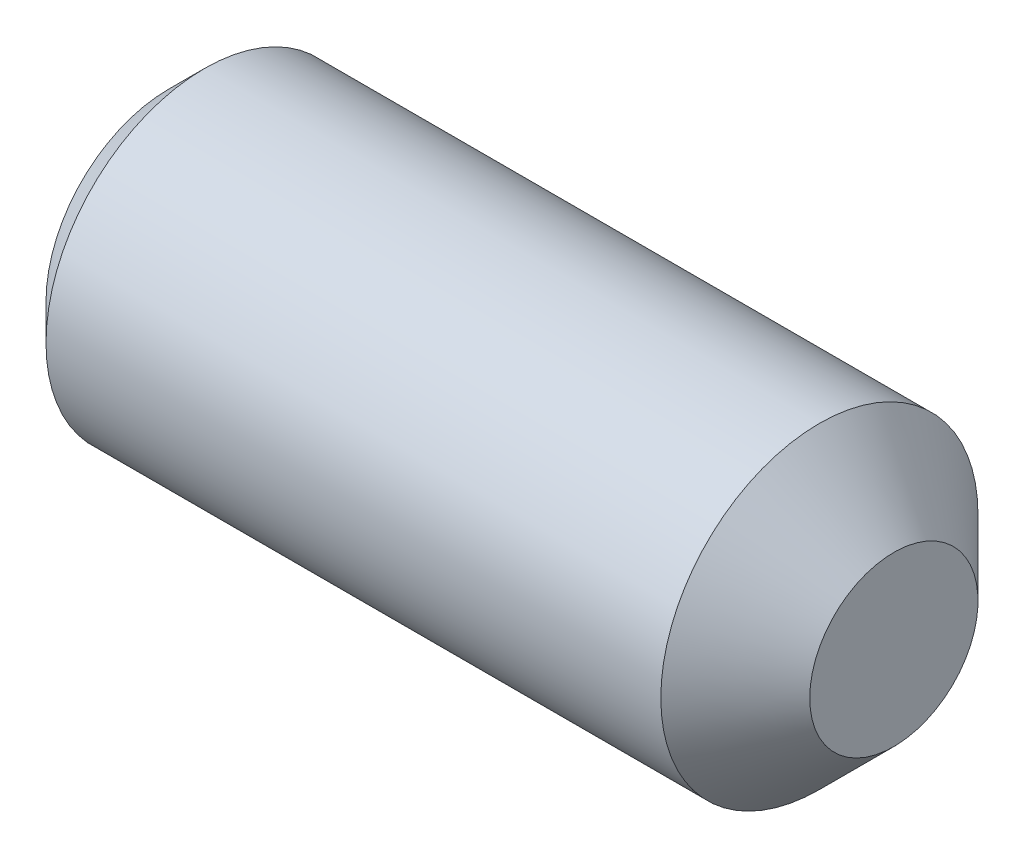
ISO-10303-21;
HEADER;
FILE_DESCRIPTION(('STEP AP214'),'2;1');
FILE_NAME('part.step','',(''),(''),'','','');
FILE_SCHEMA(('AUTOMOTIVE_DESIGN { 1 0 10303 214 1 1 1 1 }'));
ENDSEC;
DATA;
#1=APPLICATION_CONTEXT('core data for automotive mechanical design processes');
#2=APPLICATION_PROTOCOL_DEFINITION('international standard','automotive_design',2000,#1);
#3=PRODUCT_CONTEXT('',#1,'mechanical');
#4=PRODUCT('Part','Part','',(#3));
#5=PRODUCT_RELATED_PRODUCT_CATEGORY('part','',(#4));
#6=PRODUCT_DEFINITION_FORMATION('','',#4);
#7=PRODUCT_DEFINITION_CONTEXT('part definition',#1,'design');
#8=PRODUCT_DEFINITION('design','',#6,#7);
#9=PRODUCT_DEFINITION_SHAPE('','',#8);
#10=(LENGTH_UNIT() NAMED_UNIT(*) SI_UNIT(.MILLI.,.METRE.));
#11=(NAMED_UNIT(*) PLANE_ANGLE_UNIT() SI_UNIT($,.RADIAN.));
#12=(NAMED_UNIT(*) SI_UNIT($,.STERADIAN.) SOLID_ANGLE_UNIT());
#13=UNCERTAINTY_MEASURE_WITH_UNIT(LENGTH_MEASURE(1.E-05),#10,'distance_accuracy_value','');
#14=(GEOMETRIC_REPRESENTATION_CONTEXT(3) GLOBAL_UNCERTAINTY_ASSIGNED_CONTEXT((#13)) GLOBAL_UNIT_ASSIGNED_CONTEXT((#10,
#11,#12)) REPRESENTATION_CONTEXT('',''));
#15=CARTESIAN_POINT('',(0.,0.,0.));
#16=DIRECTION('',(0.,0.,1.));
#17=DIRECTION('',(1.,0.,0.));
#18=AXIS2_PLACEMENT_3D('',#15,#16,#17);
#19=CARTESIAN_POINT('',(0.,0.,0.));
#20=DIRECTION('',(-1.,0.,0.));
#21=DIRECTION('',(0.,0.,1.));
#22=AXIS2_PLACEMENT_3D('',#19,#20,#21);
#23=PLANE('',#22);
#24=CARTESIAN_POINT('',(0.,0.,0.));
#25=DIRECTION('',(-1.,0.,0.));
#26=DIRECTION('',(0.,0.,1.));
#27=AXIS2_PLACEMENT_3D('',#24,#25,#26);
#28=CIRCLE('',#27,1.61036);
#29=CARTESIAN_POINT('',(0.,0.,1.61036));
#30=VERTEX_POINT('',#29);
#31=EDGE_CURVE('E134',#30,#30,#28,.T.);
#32=ORIENTED_EDGE('',*,*,#31,.T.);
#33=EDGE_LOOP('',(#32));
#34=FACE_BOUND('',#33,.T.);
#35=DIRECTION('',(0.,0.,-1.));
#36=VECTOR('',#35,1.);
#37=CARTESIAN_POINT('',(0.,0.990600000000005,0.571923176659244));
#38=LINE('',#37,#36);
#39=CARTESIAN_POINT('',(0.,0.990600000000005,0.571923176659244));
#40=VERTEX_POINT('',#39);
#41=CARTESIAN_POINT('',(0.,0.990600000000005,-0.571923176659243));
#42=VERTEX_POINT('',#41);
#43=EDGE_CURVE('E125',#40,#42,#38,.T.);
#44=ORIENTED_EDGE('',*,*,#43,.F.);
#45=DIRECTION('',(0.,-0.866025403784439,0.5));
#46=VECTOR('',#45,1.);
#47=CARTESIAN_POINT('',(0.,0.990600000000005,0.571923176659244));
#48=LINE('',#47,#46);
#49=CARTESIAN_POINT('',(0.,0.,1.14384635331849));
#50=VERTEX_POINT('',#49);
#51=EDGE_CURVE('E47',#40,#50,#48,.T.);
#52=ORIENTED_EDGE('',*,*,#51,.T.);
#53=DIRECTION('',(0.,0.866025403784439,0.5));
#54=VECTOR('',#53,1.);
#55=CARTESIAN_POINT('',(0.,-0.990599999999996,0.571923176659244));
#56=LINE('',#55,#54);
#57=CARTESIAN_POINT('',(0.,-0.990599999999996,0.571923176659244));
#58=VERTEX_POINT('',#57);
#59=EDGE_CURVE('E116',#58,#50,#56,.T.);
#60=ORIENTED_EDGE('',*,*,#59,.F.);
#61=DIRECTION('',(0.,0.,-1.));
#62=VECTOR('',#61,1.);
#63=CARTESIAN_POINT('',(0.,-0.990599999999996,0.571923176659244));
#64=LINE('',#63,#62);
#65=CARTESIAN_POINT('',(0.,-0.990599999999996,-0.571923176659243));
#66=VERTEX_POINT('',#65);
#67=EDGE_CURVE('E119',#58,#66,#64,.T.);
#68=ORIENTED_EDGE('',*,*,#67,.T.);
#69=DIRECTION('',(0.,0.866025403784439,-0.5));
#70=VECTOR('',#69,1.);
#71=CARTESIAN_POINT('',(0.,-0.990599999999996,-0.571923176659243));
#72=LINE('',#71,#70);
#73=CARTESIAN_POINT('',(0.,0.,-1.14384635331849));
#74=VERTEX_POINT('',#73);
#75=EDGE_CURVE('E122',#66,#74,#72,.T.);
#76=ORIENTED_EDGE('',*,*,#75,.T.);
#77=DIRECTION('',(0.,-0.866025403784439,-0.5));
#78=VECTOR('',#77,1.);
#79=CARTESIAN_POINT('',(0.,0.990600000000005,-0.571923176659243));
#80=LINE('',#79,#78);
#81=EDGE_CURVE('E105',#42,#74,#80,.T.);
#82=ORIENTED_EDGE('',*,*,#81,.F.);
#83=EDGE_LOOP('',(#44,#52,#60,#68,#76,#82));
#84=FACE_BOUND('',#83,.T.);
#85=ADVANCED_FACE('F32',(#34,#84),#23,.T.);
#86=CARTESIAN_POINT('',(9.525,1.1049,0.));
#87=DIRECTION('',(1.,0.,0.));
#88=DIRECTION('',(0.,0.,-1.));
#89=AXIS2_PLACEMENT_3D('',#86,#87,#88);
#90=PLANE('',#89);
#91=CARTESIAN_POINT('',(9.525,0.,0.));
#92=DIRECTION('',(-1.,0.,0.));
#93=DIRECTION('',(0.,0.,1.));
#94=AXIS2_PLACEMENT_3D('',#91,#92,#93);
#95=CIRCLE('',#94,1.1049);
#96=CARTESIAN_POINT('',(9.525,0.,1.1049));
#97=VERTEX_POINT('',#96);
#98=EDGE_CURVE('E11',#97,#97,#95,.T.);
#99=ORIENTED_EDGE('',*,*,#98,.F.);
#100=EDGE_LOOP('',(#99));
#101=FACE_BOUND('',#100,.T.);
#102=ADVANCED_FACE('F34',(#101),#90,.T.);
#103=CARTESIAN_POINT('',(8.54710000000003,0.,0.));
#104=DIRECTION('',(-1.,0.,0.));
#105=DIRECTION('',(0.,0.,1.));
#106=AXIS2_PLACEMENT_3D('',#103,#104,#105);
#107=CONICAL_SURFACE('',#106,2.0828,0.785398163397463);
#108=ORIENTED_EDGE('',*,*,#98,.T.);
#109=EDGE_LOOP('',(#108));
#110=FACE_BOUND('',#109,.T.);
#111=CARTESIAN_POINT('',(8.54710000000003,0.,0.));
#112=DIRECTION('',(-1.,0.,0.));
#113=DIRECTION('',(0.,0.,1.));
#114=AXIS2_PLACEMENT_3D('',#111,#112,#113);
#115=CIRCLE('',#114,2.0828);
#116=CARTESIAN_POINT('',(8.54710000000003,0.,2.0828));
#117=VERTEX_POINT('',#116);
#118=EDGE_CURVE('E40',#117,#117,#115,.T.);
#119=ORIENTED_EDGE('',*,*,#118,.F.);
#120=EDGE_LOOP('',(#119));
#121=FACE_BOUND('',#120,.T.);
#122=ADVANCED_FACE('F145',(#110,#121),#107,.T.);
#123=CARTESIAN_POINT('',(-12.7,0.,0.));
#124=DIRECTION('',(-1.,0.,0.));
#125=DIRECTION('',(0.,0.,1.));
#126=AXIS2_PLACEMENT_3D('',#123,#124,#125);
#127=CYLINDRICAL_SURFACE('',#126,2.0828);
#128=ORIENTED_EDGE('',*,*,#118,.T.);
#129=EDGE_LOOP('',(#128));
#130=FACE_BOUND('',#129,.T.);
#131=CARTESIAN_POINT('',(0.472439999999998,0.,0.));
#132=DIRECTION('',(-1.,0.,0.));
#133=DIRECTION('',(0.,0.,1.));
#134=AXIS2_PLACEMENT_3D('',#131,#132,#133);
#135=CIRCLE('',#134,2.0828);
#136=CARTESIAN_POINT('',(0.472439999999998,0.,2.0828));
#137=VERTEX_POINT('',#136);
#138=EDGE_CURVE('E137',#137,#137,#135,.T.);
#139=ORIENTED_EDGE('',*,*,#138,.F.);
#140=EDGE_LOOP('',(#139));
#141=FACE_BOUND('',#140,.T.);
#142=ADVANCED_FACE('F142',(#130,#141),#127,.T.);
#143=CARTESIAN_POINT('',(0.,0.,0.));
#144=DIRECTION('',(1.,0.,0.));
#145=DIRECTION('',(0.,0.,-1.));
#146=AXIS2_PLACEMENT_3D('',#143,#144,#145);
#147=CONICAL_SURFACE('',#146,1.61036,0.78539816339745);
#148=ORIENTED_EDGE('',*,*,#138,.T.);
#149=EDGE_LOOP('',(#148));
#150=FACE_BOUND('',#149,.T.);
#151=ORIENTED_EDGE('',*,*,#31,.F.);
#152=EDGE_LOOP('',(#151));
#153=FACE_BOUND('',#152,.T.);
#154=ADVANCED_FACE('F152',(#150,#153),#147,.T.);
#155=CARTESIAN_POINT('',(2.286,0.990600000000005,0.571923176659244));
#156=DIRECTION('',(0.,-0.5,-0.866025403784439));
#157=DIRECTION('',(0.,0.866025403784439,-0.5));
#158=AXIS2_PLACEMENT_3D('',#155,#156,#157);
#159=PLANE('',#158);
#160=ORIENTED_EDGE('',*,*,#51,.F.);
#161=DIRECTION('',(-1.,0.,0.));
#162=VECTOR('',#161,1.);
#163=CARTESIAN_POINT('',(2.286,0.990600000000005,0.571923176659244));
#164=LINE('',#163,#162);
#165=CARTESIAN_POINT('',(2.286,0.990600000000005,0.571923176659244));
#166=VERTEX_POINT('',#165);
#167=EDGE_CURVE('E52',#166,#40,#164,.T.);
#168=ORIENTED_EDGE('',*,*,#167,.F.);
#169=DIRECTION('',(0.,-0.866025403784439,0.5));
#170=VECTOR('',#169,1.);
#171=CARTESIAN_POINT('',(2.286,0.990600000000005,0.571923176659244));
#172=LINE('',#171,#170);
#173=CARTESIAN_POINT('',(2.286,0.,1.14384635331849));
#174=VERTEX_POINT('',#173);
#175=EDGE_CURVE('E79',#166,#174,#172,.T.);
#176=ORIENTED_EDGE('',*,*,#175,.T.);
#177=DIRECTION('',(-1.,0.,0.));
#178=VECTOR('',#177,1.);
#179=CARTESIAN_POINT('',(2.286,0.,1.14384635331849));
#180=LINE('',#179,#178);
#181=EDGE_CURVE('E132',#174,#50,#180,.T.);
#182=ORIENTED_EDGE('',*,*,#181,.T.);
#183=EDGE_LOOP('',(#160,#168,#176,#182));
#184=FACE_BOUND('',#183,.T.);
#185=ADVANCED_FACE('F163',(#184),#159,.T.);
#186=CARTESIAN_POINT('',(2.286,-0.990599999999996,0.571923176659244));
#187=DIRECTION('',(0.,-0.5,0.866025403784439));
#188=DIRECTION('',(0.,-0.866025403784439,-0.5));
#189=AXIS2_PLACEMENT_3D('',#186,#187,#188);
#190=PLANE('',#189);
#191=ORIENTED_EDGE('',*,*,#59,.T.);
#192=ORIENTED_EDGE('',*,*,#181,.F.);
#193=DIRECTION('',(0.,0.866025403784439,0.5));
#194=VECTOR('',#193,1.);
#195=CARTESIAN_POINT('',(2.286,-0.990599999999996,0.571923176659244));
#196=LINE('',#195,#194);
#197=CARTESIAN_POINT('',(2.286,-0.990599999999996,0.571923176659244));
#198=VERTEX_POINT('',#197);
#199=EDGE_CURVE('E261',#198,#174,#196,.T.);
#200=ORIENTED_EDGE('',*,*,#199,.F.);
#201=DIRECTION('',(-1.,0.,0.));
#202=VECTOR('',#201,1.);
#203=CARTESIAN_POINT('',(2.286,-0.990599999999996,0.571923176659244));
#204=LINE('',#203,#202);
#205=EDGE_CURVE('E130',#198,#58,#204,.T.);
#206=ORIENTED_EDGE('',*,*,#205,.T.);
#207=EDGE_LOOP('',(#191,#192,#200,#206));
#208=FACE_BOUND('',#207,.T.);
#209=ADVANCED_FACE('F170',(#208),#190,.F.);
#210=CARTESIAN_POINT('',(2.286,-0.990599999999996,0.571923176659244));
#211=DIRECTION('',(0.,1.,0.));
#212=DIRECTION('',(0.,0.,1.));
#213=AXIS2_PLACEMENT_3D('',#210,#211,#212);
#214=PLANE('',#213);
#215=ORIENTED_EDGE('',*,*,#67,.F.);
#216=ORIENTED_EDGE('',*,*,#205,.F.);
#217=DIRECTION('',(0.,0.,-1.));
#218=VECTOR('',#217,1.);
#219=CARTESIAN_POINT('',(2.286,-0.990599999999996,0.571923176659244));
#220=LINE('',#219,#218);
#221=CARTESIAN_POINT('',(2.286,-0.990599999999996,-0.571923176659243));
#222=VERTEX_POINT('',#221);
#223=EDGE_CURVE('E100',#198,#222,#220,.T.);
#224=ORIENTED_EDGE('',*,*,#223,.T.);
#225=DIRECTION('',(-1.,0.,0.));
#226=VECTOR('',#225,1.);
#227=CARTESIAN_POINT('',(2.286,-0.990599999999996,-0.571923176659243));
#228=LINE('',#227,#226);
#229=EDGE_CURVE('E95',#222,#66,#228,.T.);
#230=ORIENTED_EDGE('',*,*,#229,.T.);
#231=EDGE_LOOP('',(#215,#216,#224,#230));
#232=FACE_BOUND('',#231,.T.);
#233=ADVANCED_FACE('F177',(#232),#214,.T.);
#234=CARTESIAN_POINT('',(2.286,-0.990599999999996,-0.571923176659243));
#235=DIRECTION('',(0.,0.5,0.866025403784439));
#236=DIRECTION('',(0.,-0.866025403784439,0.5));
#237=AXIS2_PLACEMENT_3D('',#234,#235,#236);
#238=PLANE('',#237);
#239=ORIENTED_EDGE('',*,*,#75,.F.);
#240=ORIENTED_EDGE('',*,*,#229,.F.);
#241=DIRECTION('',(0.,0.866025403784439,-0.5));
#242=VECTOR('',#241,1.);
#243=CARTESIAN_POINT('',(2.286,-0.990599999999996,-0.571923176659243));
#244=LINE('',#243,#242);
#245=CARTESIAN_POINT('',(2.286,0.,-1.14384635331849));
#246=VERTEX_POINT('',#245);
#247=EDGE_CURVE('E90',#222,#246,#244,.T.);
#248=ORIENTED_EDGE('',*,*,#247,.T.);
#249=DIRECTION('',(-1.,0.,0.));
#250=VECTOR('',#249,1.);
#251=CARTESIAN_POINT('',(2.286,0.,-1.14384635331849));
#252=LINE('',#251,#250);
#253=EDGE_CURVE('E94',#246,#74,#252,.T.);
#254=ORIENTED_EDGE('',*,*,#253,.T.);
#255=EDGE_LOOP('',(#239,#240,#248,#254));
#256=FACE_BOUND('',#255,.T.);
#257=ADVANCED_FACE('F93',(#256),#238,.T.);
#258=CARTESIAN_POINT('',(2.286,0.990600000000005,-0.571923176659243));
#259=DIRECTION('',(0.,0.5,-0.866025403784439));
#260=DIRECTION('',(0.,0.866025403784439,0.5));
#261=AXIS2_PLACEMENT_3D('',#258,#259,#260);
#262=PLANE('',#261);
#263=ORIENTED_EDGE('',*,*,#81,.T.);
#264=ORIENTED_EDGE('',*,*,#253,.F.);
#265=DIRECTION('',(0.,-0.866025403784439,-0.5));
#266=VECTOR('',#265,1.);
#267=CARTESIAN_POINT('',(2.286,0.990600000000005,-0.571923176659243));
#268=LINE('',#267,#266);
#269=CARTESIAN_POINT('',(2.286,0.990600000000005,-0.571923176659243));
#270=VERTEX_POINT('',#269);
#271=EDGE_CURVE('E99',#270,#246,#268,.T.);
#272=ORIENTED_EDGE('',*,*,#271,.F.);
#273=DIRECTION('',(-1.,0.,0.));
#274=VECTOR('',#273,1.);
#275=CARTESIAN_POINT('',(2.286,0.990600000000005,-0.571923176659243));
#276=LINE('',#275,#274);
#277=EDGE_CURVE('E75',#270,#42,#276,.T.);
#278=ORIENTED_EDGE('',*,*,#277,.T.);
#279=EDGE_LOOP('',(#263,#264,#272,#278));
#280=FACE_BOUND('',#279,.T.);
#281=ADVANCED_FACE('F102',(#280),#262,.F.);
#282=CARTESIAN_POINT('',(2.286,0.990600000000005,0.571923176659244));
#283=DIRECTION('',(0.,1.,0.));
#284=DIRECTION('',(0.,0.,1.));
#285=AXIS2_PLACEMENT_3D('',#282,#283,#284);
#286=PLANE('',#285);
#287=ORIENTED_EDGE('',*,*,#43,.T.);
#288=ORIENTED_EDGE('',*,*,#277,.F.);
#289=DIRECTION('',(0.,0.,-1.));
#290=VECTOR('',#289,1.);
#291=CARTESIAN_POINT('',(2.286,0.990600000000005,0.571923176659244));
#292=LINE('',#291,#290);
#293=EDGE_CURVE('E110',#166,#270,#292,.T.);
#294=ORIENTED_EDGE('',*,*,#293,.F.);
#295=ORIENTED_EDGE('',*,*,#167,.T.);
#296=EDGE_LOOP('',(#287,#288,#294,#295));
#297=FACE_BOUND('',#296,.T.);
#298=ADVANCED_FACE('F189',(#297),#286,.F.);
#299=CARTESIAN_POINT('',(2.286,-0.990599999999996,1.71576952997773));
#300=DIRECTION('',(1.,0.,0.));
#301=DIRECTION('',(0.,0.,-1.));
#302=AXIS2_PLACEMENT_3D('',#299,#300,#301);
#303=PLANE('',#302);
#304=ORIENTED_EDGE('',*,*,#175,.F.);
#305=ORIENTED_EDGE('',*,*,#293,.T.);
#306=ORIENTED_EDGE('',*,*,#271,.T.);
#307=ORIENTED_EDGE('',*,*,#247,.F.);
#308=ORIENTED_EDGE('',*,*,#223,.F.);
#309=ORIENTED_EDGE('',*,*,#199,.T.);
#310=EDGE_LOOP('',(#304,#305,#306,#307,#308,#309));
#311=FACE_BOUND('',#310,.T.);
#312=ADVANCED_FACE('F108',(#311),#303,.F.);
#313=CLOSED_SHELL('',(#85,#102,#122,#142,#154,#185,#209,#233,#257,#281,#298,#312));
#314=MANIFOLD_SOLID_BREP('B2',#313);
#315=ADVANCED_BREP_SHAPE_REPRESENTATION('',(#18,#314),#14);
#316=SHAPE_DEFINITION_REPRESENTATION(#9,#315);
ENDSEC;
END-ISO-10303-21;
